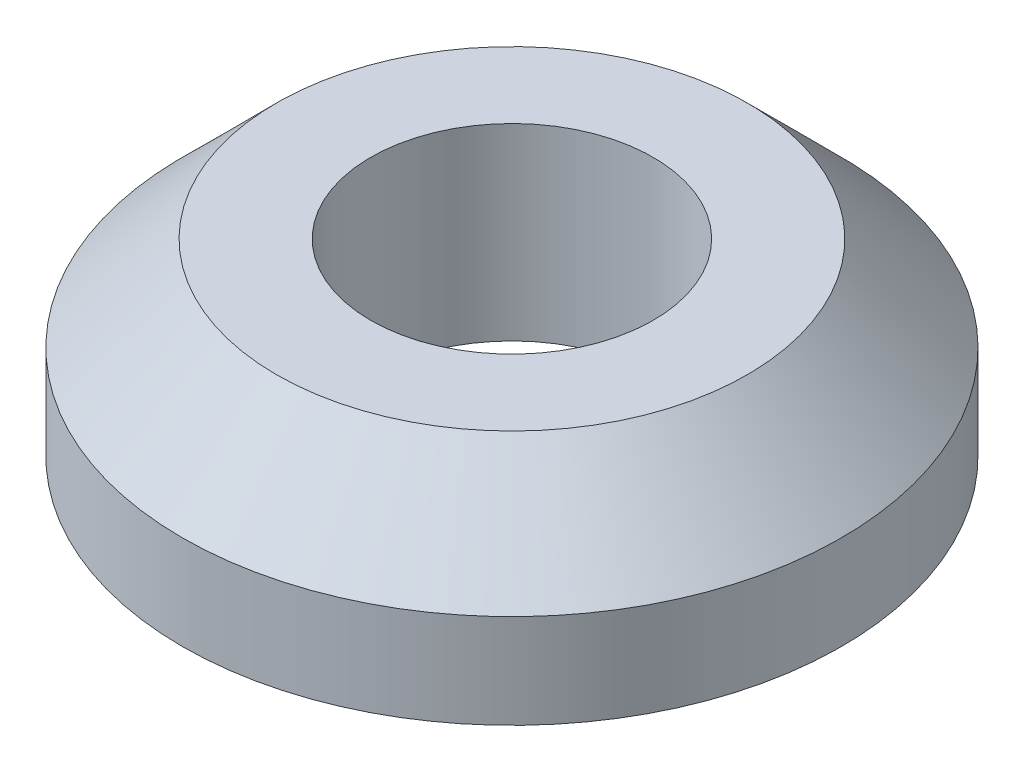
ISO-10303-21;
HEADER;
FILE_DESCRIPTION(('STEP AP214'),'2;1');
FILE_NAME('part.step','',(''),(''),'','','');
FILE_SCHEMA(('AUTOMOTIVE_DESIGN { 1 0 10303 214 1 1 1 1 }'));
ENDSEC;
DATA;
#1=APPLICATION_CONTEXT('core data for automotive mechanical design processes');
#2=APPLICATION_PROTOCOL_DEFINITION('international standard','automotive_design',2000,#1);
#3=PRODUCT_CONTEXT('',#1,'mechanical');
#4=PRODUCT('Part','Part','',(#3));
#5=PRODUCT_RELATED_PRODUCT_CATEGORY('part','',(#4));
#6=PRODUCT_DEFINITION_FORMATION('','',#4);
#7=PRODUCT_DEFINITION_CONTEXT('part definition',#1,'design');
#8=PRODUCT_DEFINITION('design','',#6,#7);
#9=PRODUCT_DEFINITION_SHAPE('','',#8);
#10=(LENGTH_UNIT() NAMED_UNIT(*) SI_UNIT(.MILLI.,.METRE.));
#11=(NAMED_UNIT(*) PLANE_ANGLE_UNIT() SI_UNIT($,.RADIAN.));
#12=(NAMED_UNIT(*) SI_UNIT($,.STERADIAN.) SOLID_ANGLE_UNIT());
#13=UNCERTAINTY_MEASURE_WITH_UNIT(LENGTH_MEASURE(1.E-05),#10,'distance_accuracy_value','');
#14=(GEOMETRIC_REPRESENTATION_CONTEXT(3) GLOBAL_UNCERTAINTY_ASSIGNED_CONTEXT((#13)) GLOBAL_UNIT_ASSIGNED_CONTEXT((#10,
#11,#12)) REPRESENTATION_CONTEXT('',''));
#15=CARTESIAN_POINT('',(0.,0.,0.));
#16=DIRECTION('',(0.,0.,1.));
#17=DIRECTION('',(1.,0.,0.));
#18=AXIS2_PLACEMENT_3D('',#15,#16,#17);
#19=CARTESIAN_POINT('',(0.,2.,0.));
#20=DIRECTION('',(0.,-1.,0.));
#21=DIRECTION('',(0.,0.,-1.));
#22=AXIS2_PLACEMENT_3D('',#19,#20,#21);
#23=CYLINDRICAL_SURFACE('',#22,3.5);
#24=CARTESIAN_POINT('',(0.,0.999999999999998,0.));
#25=DIRECTION('',(0.,1.,0.));
#26=DIRECTION('',(0.,0.,1.));
#27=AXIS2_PLACEMENT_3D('',#24,#25,#26);
#28=CIRCLE('',#27,3.5);
#29=CARTESIAN_POINT('',(0.,0.999999999999998,3.5));
#30=VERTEX_POINT('',#29);
#31=EDGE_CURVE('E10',#30,#30,#28,.F.);
#32=ORIENTED_EDGE('',*,*,#31,.T.);
#33=EDGE_LOOP('',(#32));
#34=FACE_BOUND('',#33,.T.);
#35=CARTESIAN_POINT('',(0.,0.,0.));
#36=DIRECTION('',(0.,1.,0.));
#37=DIRECTION('',(0.,0.,1.));
#38=AXIS2_PLACEMENT_3D('',#35,#36,#37);
#39=CIRCLE('',#38,3.5);
#40=CARTESIAN_POINT('',(0.,0.,3.5));
#41=VERTEX_POINT('',#40);
#42=EDGE_CURVE('E48',#41,#41,#39,.T.);
#43=ORIENTED_EDGE('',*,*,#42,.T.);
#44=EDGE_LOOP('',(#43));
#45=FACE_BOUND('',#44,.T.);
#46=ADVANCED_FACE('F36',(#34,#45),#23,.T.);
#47=CARTESIAN_POINT('',(0.,2.,0.));
#48=DIRECTION('',(0.,1.,0.));
#49=DIRECTION('',(0.,0.,1.));
#50=AXIS2_PLACEMENT_3D('',#47,#48,#49);
#51=PLANE('',#50);
#52=CARTESIAN_POINT('',(0.,2.,0.));
#53=DIRECTION('',(0.,1.,0.));
#54=DIRECTION('',(0.,0.,1.));
#55=AXIS2_PLACEMENT_3D('',#52,#53,#54);
#56=CIRCLE('',#55,1.5);
#57=CARTESIAN_POINT('',(0.,2.,1.5));
#58=VERTEX_POINT('',#57);
#59=EDGE_CURVE('E55',#58,#58,#56,.T.);
#60=ORIENTED_EDGE('',*,*,#59,.F.);
#61=EDGE_LOOP('',(#60));
#62=FACE_BOUND('',#61,.T.);
#63=CARTESIAN_POINT('',(0.,2.,0.));
#64=DIRECTION('',(0.,1.,0.));
#65=DIRECTION('',(0.,0.,1.));
#66=AXIS2_PLACEMENT_3D('',#63,#64,#65);
#67=CIRCLE('',#66,2.5);
#68=CARTESIAN_POINT('',(0.,2.,2.5));
#69=VERTEX_POINT('',#68);
#70=EDGE_CURVE('E44',#69,#69,#67,.T.);
#71=ORIENTED_EDGE('',*,*,#70,.T.);
#72=EDGE_LOOP('',(#71));
#73=FACE_BOUND('',#72,.T.);
#74=ADVANCED_FACE('F70',(#62,#73),#51,.T.);
#75=CARTESIAN_POINT('',(0.,0.,0.));
#76=DIRECTION('',(0.,1.,0.));
#77=DIRECTION('',(0.,0.,1.));
#78=AXIS2_PLACEMENT_3D('',#75,#76,#77);
#79=PLANE('',#78);
#80=CARTESIAN_POINT('',(0.,0.,0.));
#81=DIRECTION('',(0.,1.,0.));
#82=DIRECTION('',(0.,0.,1.));
#83=AXIS2_PLACEMENT_3D('',#80,#81,#82);
#84=CIRCLE('',#83,1.5);
#85=CARTESIAN_POINT('',(0.,0.,1.5));
#86=VERTEX_POINT('',#85);
#87=EDGE_CURVE('E52',#86,#86,#84,.T.);
#88=ORIENTED_EDGE('',*,*,#87,.T.);
#89=EDGE_LOOP('',(#88));
#90=FACE_BOUND('',#89,.T.);
#91=ORIENTED_EDGE('',*,*,#42,.F.);
#92=EDGE_LOOP('',(#91));
#93=FACE_BOUND('',#92,.T.);
#94=ADVANCED_FACE('F61',(#90,#93),#79,.F.);
#95=CARTESIAN_POINT('',(0.,2.,0.));
#96=DIRECTION('',(0.,-1.,0.));
#97=DIRECTION('',(0.,0.,-1.));
#98=AXIS2_PLACEMENT_3D('',#95,#96,#97);
#99=CONICAL_SURFACE('',#98,2.5,0.785398163397447);
#100=ORIENTED_EDGE('',*,*,#31,.F.);
#101=EDGE_LOOP('',(#100));
#102=FACE_BOUND('',#101,.T.);
#103=ORIENTED_EDGE('',*,*,#70,.F.);
#104=EDGE_LOOP('',(#103));
#105=FACE_BOUND('',#104,.T.);
#106=ADVANCED_FACE('F39',(#102,#105),#99,.T.);
#107=CARTESIAN_POINT('',(0.,0.,0.));
#108=DIRECTION('',(0.,1.,0.));
#109=DIRECTION('',(0.,0.,1.));
#110=AXIS2_PLACEMENT_3D('',#107,#108,#109);
#111=CYLINDRICAL_SURFACE('',#110,1.5);
#112=ORIENTED_EDGE('',*,*,#87,.F.);
#113=EDGE_LOOP('',(#112));
#114=FACE_BOUND('',#113,.T.);
#115=ORIENTED_EDGE('',*,*,#59,.T.);
#116=EDGE_LOOP('',(#115));
#117=FACE_BOUND('',#116,.T.);
#118=ADVANCED_FACE('F64',(#114,#117),#111,.F.);
#119=CLOSED_SHELL('',(#46,#74,#94,#106,#118));
#120=MANIFOLD_SOLID_BREP('B2',#119);
#121=ADVANCED_BREP_SHAPE_REPRESENTATION('',(#18,#120),#14);
#122=SHAPE_DEFINITION_REPRESENTATION(#9,#121);
ENDSEC;
END-ISO-10303-21;
